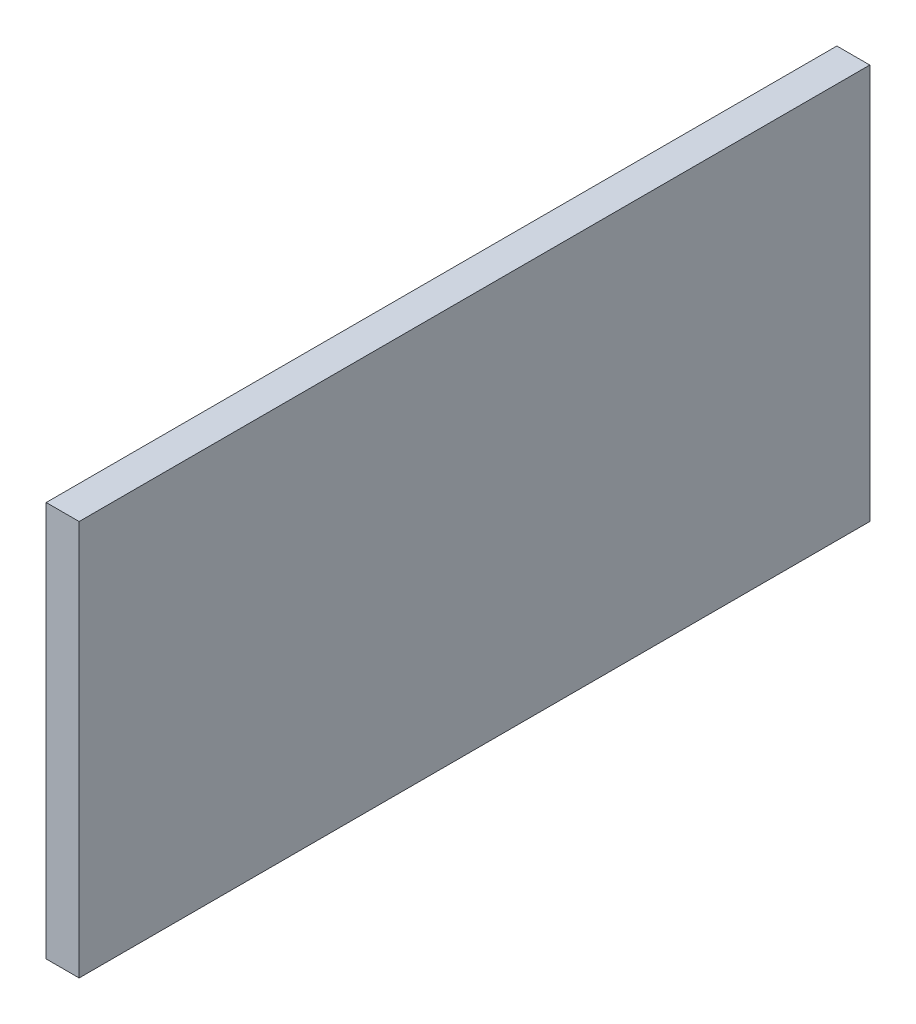
ISO-10303-21;
HEADER;
FILE_DESCRIPTION(('STEP AP214'),'2;1');
FILE_NAME('part.step','',(''),(''),'','','');
FILE_SCHEMA(('AUTOMOTIVE_DESIGN { 1 0 10303 214 1 1 1 1 }'));
ENDSEC;
DATA;
#1=APPLICATION_CONTEXT('core data for automotive mechanical design processes');
#2=APPLICATION_PROTOCOL_DEFINITION('international standard','automotive_design',2000,#1);
#3=PRODUCT_CONTEXT('',#1,'mechanical');
#4=PRODUCT('Part','Part','',(#3));
#5=PRODUCT_RELATED_PRODUCT_CATEGORY('part','',(#4));
#6=PRODUCT_DEFINITION_FORMATION('','',#4);
#7=PRODUCT_DEFINITION_CONTEXT('part definition',#1,'design');
#8=PRODUCT_DEFINITION('design','',#6,#7);
#9=PRODUCT_DEFINITION_SHAPE('','',#8);
#10=(LENGTH_UNIT() NAMED_UNIT(*) SI_UNIT(.MILLI.,.METRE.));
#11=(NAMED_UNIT(*) PLANE_ANGLE_UNIT() SI_UNIT($,.RADIAN.));
#12=(NAMED_UNIT(*) SI_UNIT($,.STERADIAN.) SOLID_ANGLE_UNIT());
#13=UNCERTAINTY_MEASURE_WITH_UNIT(LENGTH_MEASURE(1.E-05),#10,'distance_accuracy_value','');
#14=(GEOMETRIC_REPRESENTATION_CONTEXT(3) GLOBAL_UNCERTAINTY_ASSIGNED_CONTEXT((#13)) GLOBAL_UNIT_ASSIGNED_CONTEXT((#10,
#11,#12)) REPRESENTATION_CONTEXT('',''));
#15=CARTESIAN_POINT('',(0.,0.,0.));
#16=DIRECTION('',(0.,0.,1.));
#17=DIRECTION('',(1.,0.,0.));
#18=AXIS2_PLACEMENT_3D('',#15,#16,#17);
#19=CARTESIAN_POINT('',(12.7,76.2,-152.4));
#20=DIRECTION('',(0.,0.,1.));
#21=DIRECTION('',(0.,-1.,0.));
#22=AXIS2_PLACEMENT_3D('',#19,#20,#21);
#23=PLANE('',#22);
#24=DIRECTION('',(0.,1.,0.));
#25=VECTOR('',#24,1.);
#26=CARTESIAN_POINT('',(0.,76.2,-152.4));
#27=LINE('',#26,#25);
#28=CARTESIAN_POINT('',(0.,-76.2,-152.4));
#29=VERTEX_POINT('',#28);
#30=CARTESIAN_POINT('',(0.,76.2,-152.4));
#31=VERTEX_POINT('',#30);
#32=EDGE_CURVE('E107',#29,#31,#27,.T.);
#33=ORIENTED_EDGE('',*,*,#32,.T.);
#34=DIRECTION('',(-1.,0.,0.));
#35=VECTOR('',#34,1.);
#36=CARTESIAN_POINT('',(12.7,76.2,-152.4));
#37=LINE('',#36,#35);
#38=CARTESIAN_POINT('',(12.7,76.2,-152.4));
#39=VERTEX_POINT('',#38);
#40=EDGE_CURVE('E11',#39,#31,#37,.T.);
#41=ORIENTED_EDGE('',*,*,#40,.F.);
#42=DIRECTION('',(0.,1.,0.));
#43=VECTOR('',#42,1.);
#44=CARTESIAN_POINT('',(12.7,76.2,-152.4));
#45=LINE('',#44,#43);
#46=CARTESIAN_POINT('',(12.7,-76.2,-152.4));
#47=VERTEX_POINT('',#46);
#48=EDGE_CURVE('E91',#47,#39,#45,.T.);
#49=ORIENTED_EDGE('',*,*,#48,.F.);
#50=DIRECTION('',(-1.,0.,0.));
#51=VECTOR('',#50,1.);
#52=CARTESIAN_POINT('',(12.7,-76.2,-152.4));
#53=LINE('',#52,#51);
#54=EDGE_CURVE('E103',#47,#29,#53,.T.);
#55=ORIENTED_EDGE('',*,*,#54,.T.);
#56=EDGE_LOOP('',(#33,#41,#49,#55));
#57=FACE_BOUND('',#56,.T.);
#58=ADVANCED_FACE('F39',(#57),#23,.F.);
#59=CARTESIAN_POINT('',(12.7,76.2,152.4));
#60=DIRECTION('',(0.,-1.,0.));
#61=DIRECTION('',(0.,0.,-1.));
#62=AXIS2_PLACEMENT_3D('',#59,#60,#61);
#63=PLANE('',#62);
#64=DIRECTION('',(0.,0.,1.));
#65=VECTOR('',#64,1.);
#66=CARTESIAN_POINT('',(0.,76.2,152.4));
#67=LINE('',#66,#65);
#68=CARTESIAN_POINT('',(0.,76.2,152.4));
#69=VERTEX_POINT('',#68);
#70=EDGE_CURVE('E96',#31,#69,#67,.T.);
#71=ORIENTED_EDGE('',*,*,#70,.T.);
#72=DIRECTION('',(-1.,0.,0.));
#73=VECTOR('',#72,1.);
#74=CARTESIAN_POINT('',(12.7,76.2,152.4));
#75=LINE('',#74,#73);
#76=CARTESIAN_POINT('',(12.7,76.2,152.4));
#77=VERTEX_POINT('',#76);
#78=EDGE_CURVE('E48',#77,#69,#75,.T.);
#79=ORIENTED_EDGE('',*,*,#78,.F.);
#80=DIRECTION('',(0.,0.,1.));
#81=VECTOR('',#80,1.);
#82=CARTESIAN_POINT('',(12.7,76.2,152.4));
#83=LINE('',#82,#81);
#84=EDGE_CURVE('E86',#39,#77,#83,.T.);
#85=ORIENTED_EDGE('',*,*,#84,.F.);
#86=ORIENTED_EDGE('',*,*,#40,.T.);
#87=EDGE_LOOP('',(#71,#79,#85,#86));
#88=FACE_BOUND('',#87,.T.);
#89=ADVANCED_FACE('F95',(#88),#63,.F.);
#90=CARTESIAN_POINT('',(12.7,76.2,152.4));
#91=DIRECTION('',(0.,0.,-1.));
#92=DIRECTION('',(0.,1.,0.));
#93=AXIS2_PLACEMENT_3D('',#90,#91,#92);
#94=PLANE('',#93);
#95=DIRECTION('',(0.,-1.,0.));
#96=VECTOR('',#95,1.);
#97=CARTESIAN_POINT('',(0.,76.2,152.4));
#98=LINE('',#97,#96);
#99=CARTESIAN_POINT('',(0.,-76.2,152.4));
#100=VERTEX_POINT('',#99);
#101=EDGE_CURVE('E73',#69,#100,#98,.T.);
#102=ORIENTED_EDGE('',*,*,#101,.T.);
#103=DIRECTION('',(-1.,0.,0.));
#104=VECTOR('',#103,1.);
#105=CARTESIAN_POINT('',(12.7,-76.2,152.4));
#106=LINE('',#105,#104);
#107=CARTESIAN_POINT('',(12.7,-76.2,152.4));
#108=VERTEX_POINT('',#107);
#109=EDGE_CURVE('E98',#108,#100,#106,.T.);
#110=ORIENTED_EDGE('',*,*,#109,.F.);
#111=DIRECTION('',(0.,-1.,0.));
#112=VECTOR('',#111,1.);
#113=CARTESIAN_POINT('',(12.7,76.2,152.4));
#114=LINE('',#113,#112);
#115=EDGE_CURVE('E89',#77,#108,#114,.T.);
#116=ORIENTED_EDGE('',*,*,#115,.F.);
#117=ORIENTED_EDGE('',*,*,#78,.T.);
#118=EDGE_LOOP('',(#102,#110,#116,#117));
#119=FACE_BOUND('',#118,.T.);
#120=ADVANCED_FACE('F99',(#119),#94,.F.);
#121=CARTESIAN_POINT('',(12.7,-76.2,152.4));
#122=DIRECTION('',(0.,1.,0.));
#123=DIRECTION('',(0.,0.,1.));
#124=AXIS2_PLACEMENT_3D('',#121,#122,#123);
#125=PLANE('',#124);
#126=DIRECTION('',(0.,0.,-1.));
#127=VECTOR('',#126,1.);
#128=CARTESIAN_POINT('',(0.,-76.2,152.4));
#129=LINE('',#128,#127);
#130=EDGE_CURVE('E79',#100,#29,#129,.T.);
#131=ORIENTED_EDGE('',*,*,#130,.T.);
#132=ORIENTED_EDGE('',*,*,#54,.F.);
#133=DIRECTION('',(0.,0.,-1.));
#134=VECTOR('',#133,1.);
#135=CARTESIAN_POINT('',(12.7,-76.2,152.4));
#136=LINE('',#135,#134);
#137=EDGE_CURVE('E56',#108,#47,#136,.T.);
#138=ORIENTED_EDGE('',*,*,#137,.F.);
#139=ORIENTED_EDGE('',*,*,#109,.T.);
#140=EDGE_LOOP('',(#131,#132,#138,#139));
#141=FACE_BOUND('',#140,.T.);
#142=ADVANCED_FACE('F120',(#141),#125,.F.);
#143=CARTESIAN_POINT('',(12.7,0.,0.));
#144=DIRECTION('',(1.,0.,0.));
#145=DIRECTION('',(0.,0.,-1.));
#146=AXIS2_PLACEMENT_3D('',#143,#144,#145);
#147=PLANE('',#146);
#148=ORIENTED_EDGE('',*,*,#48,.T.);
#149=ORIENTED_EDGE('',*,*,#84,.T.);
#150=ORIENTED_EDGE('',*,*,#115,.T.);
#151=ORIENTED_EDGE('',*,*,#137,.T.);
#152=EDGE_LOOP('',(#148,#149,#150,#151));
#153=FACE_BOUND('',#152,.T.);
#154=ADVANCED_FACE('F87',(#153),#147,.T.);
#155=CARTESIAN_POINT('',(0.,0.,0.));
#156=DIRECTION('',(1.,0.,0.));
#157=DIRECTION('',(0.,0.,-1.));
#158=AXIS2_PLACEMENT_3D('',#155,#156,#157);
#159=PLANE('',#158);
#160=ORIENTED_EDGE('',*,*,#32,.F.);
#161=ORIENTED_EDGE('',*,*,#130,.F.);
#162=ORIENTED_EDGE('',*,*,#101,.F.);
#163=ORIENTED_EDGE('',*,*,#70,.F.);
#164=EDGE_LOOP('',(#160,#161,#162,#163));
#165=FACE_BOUND('',#164,.T.);
#166=ADVANCED_FACE('F123',(#165),#159,.F.);
#167=CLOSED_SHELL('',(#58,#89,#120,#142,#154,#166));
#168=MANIFOLD_SOLID_BREP('B2',#167);
#169=ADVANCED_BREP_SHAPE_REPRESENTATION('',(#18,#168),#14);
#170=SHAPE_DEFINITION_REPRESENTATION(#9,#169);
ENDSEC;
END-ISO-10303-21;
